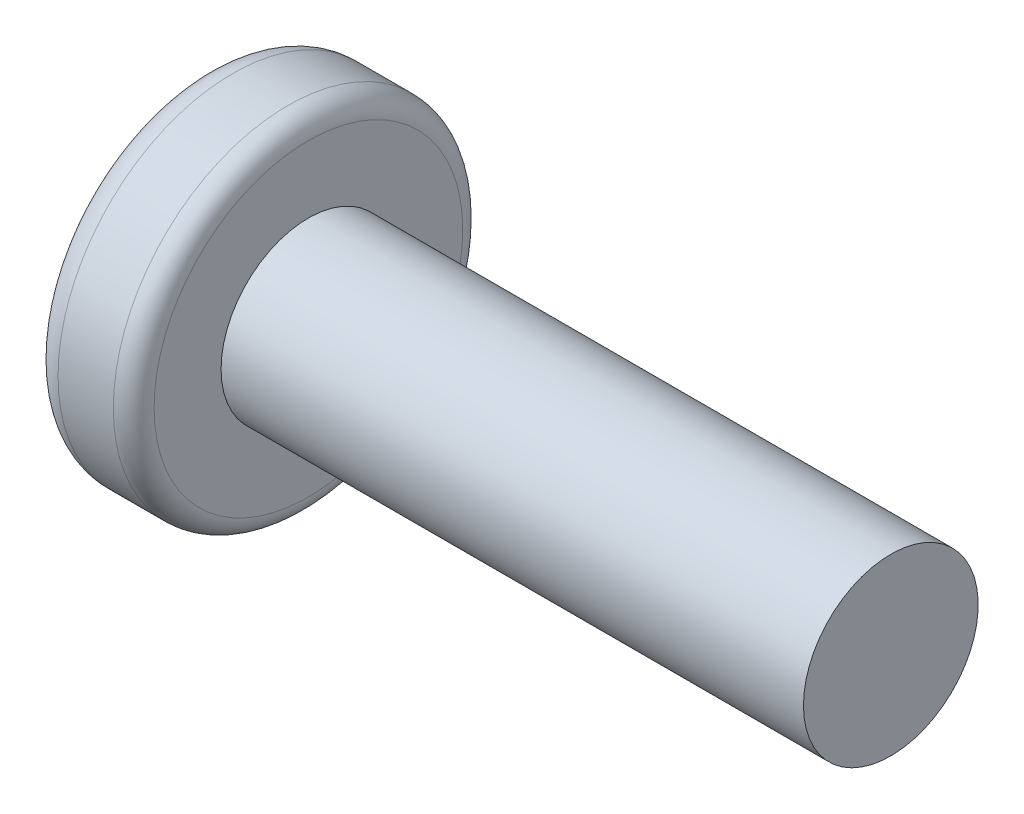
ISO-10303-21;
HEADER;
FILE_DESCRIPTION(('STEP AP214'),'2;1');
FILE_NAME('part.step','',(''),(''),'','','');
FILE_SCHEMA(('AUTOMOTIVE_DESIGN { 1 0 10303 214 1 1 1 1 }'));
ENDSEC;
DATA;
#1=APPLICATION_CONTEXT('core data for automotive mechanical design processes');
#2=APPLICATION_PROTOCOL_DEFINITION('international standard','automotive_design',2000,#1);
#3=PRODUCT_CONTEXT('',#1,'mechanical');
#4=PRODUCT('Part','Part','',(#3));
#5=PRODUCT_RELATED_PRODUCT_CATEGORY('part','',(#4));
#6=PRODUCT_DEFINITION_FORMATION('','',#4);
#7=PRODUCT_DEFINITION_CONTEXT('part definition',#1,'design');
#8=PRODUCT_DEFINITION('design','',#6,#7);
#9=PRODUCT_DEFINITION_SHAPE('','',#8);
#10=(LENGTH_UNIT() NAMED_UNIT(*) SI_UNIT(.MILLI.,.METRE.));
#11=(NAMED_UNIT(*) PLANE_ANGLE_UNIT() SI_UNIT($,.RADIAN.));
#12=(NAMED_UNIT(*) SI_UNIT($,.STERADIAN.) SOLID_ANGLE_UNIT());
#13=UNCERTAINTY_MEASURE_WITH_UNIT(LENGTH_MEASURE(1.E-05),#10,'distance_accuracy_value','');
#14=(GEOMETRIC_REPRESENTATION_CONTEXT(3) GLOBAL_UNCERTAINTY_ASSIGNED_CONTEXT((#13)) GLOBAL_UNIT_ASSIGNED_CONTEXT((#10,
#11,#12)) REPRESENTATION_CONTEXT('',''));
#15=CARTESIAN_POINT('',(0.,0.,0.));
#16=DIRECTION('',(0.,0.,1.));
#17=DIRECTION('',(1.,0.,0.));
#18=AXIS2_PLACEMENT_3D('',#15,#16,#17);
#19=CARTESIAN_POINT('',(1.8,-0.652553136470314,0.37));
#20=DIRECTION('',(0.,0.,-1.));
#21=DIRECTION('',(0.,1.,0.));
#22=AXIS2_PLACEMENT_3D('',#19,#20,#21);
#23=PLANE('',#22);
#24=DIRECTION('',(0.,1.,0.));
#25=VECTOR('',#24,1.);
#26=CARTESIAN_POINT('',(1.8,-0.652553136470314,0.37));
#27=LINE('',#26,#25);
#28=CARTESIAN_POINT('',(1.80000000000136,-0.415013252797762,0.37));
#29=VERTEX_POINT('',#28);
#30=CARTESIAN_POINT('',(1.8,-0.652553136470314,0.37));
#31=VERTEX_POINT('',#30);
#32=EDGE_CURVE('E155',#29,#31,#27,.F.);
#33=ORIENTED_EDGE('',*,*,#32,.T.);
#34=DIRECTION('',(0.89493436774996,0.446197800778958,0.));
#35=VECTOR('',#34,1.);
#36=CARTESIAN_POINT('',(0.,-1.55,0.37));
#37=LINE('',#36,#35);
#38=CARTESIAN_POINT('',(0.190827025346033,-1.45485715812583,0.370000000000001));
#39=VERTEX_POINT('',#38);
#40=EDGE_CURVE('E159',#31,#39,#37,.F.);
#41=ORIENTED_EDGE('',*,*,#40,.T.);
#42=CARTESIAN_POINT('',(0.190827025346032,-1.45485715812583,0.370000000000002));
#43=CARTESIAN_POINT('',(0.154367302900051,-1.30921009338373,0.370000000000002));
#44=CARTESIAN_POINT('',(0.12344880942392,-1.1626100074816,0.370000000000001));
#45=CARTESIAN_POINT('',(0.0726942804113583,-0.867503793357298,0.369999999999998));
#46=CARTESIAN_POINT('',(0.052858244874928,-0.718997665135119,0.369999999999996));
#47=CARTESIAN_POINT('',(0.0385634383083481,-0.569538515752914,0.369999999999994));
#48=B_SPLINE_CURVE_WITH_KNOTS('',3,(#42,#43,#44,#45,#46,#47),.UNSPECIFIED.,.F.,.F.,(4,2,4),(0.,
0.449475078094551,0.898950156189102),.UNSPECIFIED.);
#49=CARTESIAN_POINT('',(0.038563438301731,-0.569538515752785,0.369999999999999));
#50=VERTEX_POINT('',#49);
#51=EDGE_CURVE('E143',#39,#50,#48,.T.);
#52=ORIENTED_EDGE('',*,*,#51,.T.);
#53=CARTESIAN_POINT('',(0.0385634383038601,-0.569538515751931,0.37));
#54=CARTESIAN_POINT('',(0.249459860542259,-0.551934923003464,0.37));
#55=CARTESIAN_POINT('',(0.460339859439293,-0.534123508070556,0.37));
#56=CARTESIAN_POINT('',(0.882041379360187,-0.497847880570011,0.37));
#57=CARTESIAN_POINT('',(1.09286290096693,-0.479383674763409,0.37));
#58=CARTESIAN_POINT('',(1.38638432292663,-0.45305167766455,0.37));
#59=CARTESIAN_POINT('',(1.46911795021578,-0.445560447387079,0.37));
#60=CARTESIAN_POINT('',(1.63457063757802,-0.430415263407796,0.37));
#61=CARTESIAN_POINT('',(1.71728969759097,-0.422761309049558,0.37));
#62=CARTESIAN_POINT('',(1.80000000000095,-0.415013252799572,0.37));
#63=B_SPLINE_CURVE_WITH_KNOTS('',3,(#53,#54,#55,#56,#57,#58,#59,#60,#61,#62),.UNSPECIFIED.,.F.,
.F.,(4,2,2,2,4),(0.,0.634890893100427,1.2697752124818,1.51899132187324,1.76820843679097),.UNSPECIFIED.);
#64=EDGE_CURVE('E162',#50,#29,#63,.T.);
#65=ORIENTED_EDGE('',*,*,#64,.T.);
#66=EDGE_LOOP('',(#33,#41,#52,#65));
#67=FACE_BOUND('',#66,.T.);
#68=ADVANCED_FACE('F16',(#67),#23,.T.);
#69=CARTESIAN_POINT('',(0.,-1.55,-0.37));
#70=DIRECTION('',(0.446197800778958,-0.89493436774996,0.));
#71=DIRECTION('',(0.89493436774996,0.446197800778958,0.));
#72=AXIS2_PLACEMENT_3D('',#69,#70,#71);
#73=PLANE('',#72);
#74=DIRECTION('',(0.,0.,1.));
#75=VECTOR('',#74,1.);
#76=CARTESIAN_POINT('',(1.8,-0.652553136470314,-0.37));
#77=LINE('',#76,#75);
#78=CARTESIAN_POINT('',(1.8,-0.652553136470314,-0.37));
#79=VERTEX_POINT('',#78);
#80=EDGE_CURVE('E163',#79,#31,#77,.T.);
#81=ORIENTED_EDGE('',*,*,#80,.F.);
#82=DIRECTION('',(0.89493436774996,0.446197800778958,0.));
#83=VECTOR('',#82,1.);
#84=CARTESIAN_POINT('',(0.190827025346033,-1.45485715812583,-0.37));
#85=LINE('',#84,#83);
#86=CARTESIAN_POINT('',(0.190827025346033,-1.45485715812583,-0.37));
#87=VERTEX_POINT('',#86);
#88=EDGE_CURVE('E387',#87,#79,#85,.T.);
#89=ORIENTED_EDGE('',*,*,#88,.F.);
#90=CARTESIAN_POINT('',(0.180362378138894,-1.46007463857805,0.));
#91=CARTESIAN_POINT('',(0.180362378138894,-1.46007463857805,-0.185184771545176));
#92=CARTESIAN_POINT('',(0.190827025346033,-1.45485715812583,-0.37));
#93=B_SPLINE_CURVE_WITH_KNOTS('',2,(#90,#91,#92),.UNSPECIFIED.,.F.,.F.,(3,3),(0.,1.),.UNSPECIFIED.);
#94=CARTESIAN_POINT('',(0.180362378138895,-1.46007463857805,0.));
#95=VERTEX_POINT('',#94);
#96=EDGE_CURVE('E167',#95,#87,#93,.T.);
#97=ORIENTED_EDGE('',*,*,#96,.F.);
#98=CARTESIAN_POINT('',(0.190827025346033,-1.45485715812583,0.37));
#99=CARTESIAN_POINT('',(0.180362378138894,-1.46007463857805,0.185184771545178));
#100=CARTESIAN_POINT('',(0.180362378138894,-1.46007463857805,0.));
#101=B_SPLINE_CURVE_WITH_KNOTS('',2,(#98,#99,#100),.UNSPECIFIED.,.F.,.F.,(3,3),(0.,1.),.UNSPECIFIED.);
#102=EDGE_CURVE('E148',#39,#95,#101,.T.);
#103=ORIENTED_EDGE('',*,*,#102,.F.);
#104=ORIENTED_EDGE('',*,*,#40,.F.);
#105=EDGE_LOOP('',(#81,#89,#97,#103,#104));
#106=FACE_BOUND('',#105,.T.);
#107=ADVANCED_FACE('F165',(#106),#73,.F.);
#108=CARTESIAN_POINT('',(0.0385634382951139,0.,0.));
#109=DIRECTION('',(-1.,0.,0.));
#110=DIRECTION('',(0.,0.,1.));
#111=AXIS2_PLACEMENT_3D('',#108,#109,#110);
#112=CONICAL_SURFACE('',#111,0.679171643199084,0.0698131700791993);
#113=CARTESIAN_POINT('',(1.80000000000041,-0.370000000000004,0.415013252799509));
#114=CARTESIAN_POINT('',(1.62750312328878,-0.370000000000004,0.431158408094592));
#115=CARTESIAN_POINT('',(1.4549709538658,-0.370000000000004,0.446919627327146));
#116=CARTESIAN_POINT('',(1.10985337183026,-0.370000000000004,0.477835185334835));
#117=CARTESIAN_POINT('',(0.937267959598439,-0.370000000000004,0.492989528352763));
#118=CARTESIAN_POINT('',(0.643663887499248,-0.370000000000004,0.518388345690766));
#119=CARTESIAN_POINT('',(0.522654970223464,-0.370000000000004,0.528746146338188));
#120=CARTESIAN_POINT('',(0.280620669817226,-0.370000000000004,0.549274675541428));
#121=CARTESIAN_POINT('',(0.159595286609809,-0.370000000000004,0.559445403190324));
#122=CARTESIAN_POINT('',(0.0385634383060557,-0.370000000000004,0.56953851575178));
#123=B_SPLINE_CURVE_WITH_KNOTS('',3,(#113,#114,#115,#116,#117,#118,#119,#120,#121,#122),
.UNSPECIFIED.,.F.,.F.,(4,2,2,2,4),(0.,0.519751057577864,1.03949848083731,1.4038525661412,
1.76820841735493),.UNSPECIFIED.);
#124=CARTESIAN_POINT('',(1.80000000000136,-0.370000000000004,0.415013252797758));
#125=VERTEX_POINT('',#124);
#126=CARTESIAN_POINT('',(0.0385634383017358,-0.370000000000004,0.569538515718253));
#127=VERTEX_POINT('',#126);
#128=EDGE_CURVE('E195',#125,#127,#123,.T.);
#129=ORIENTED_EDGE('',*,*,#128,.F.);
#130=CARTESIAN_POINT('',(1.80000000000291,0.,0.));
#131=DIRECTION('',(-1.,0.,0.));
#132=DIRECTION('',(0.,0.,1.));
#133=AXIS2_PLACEMENT_3D('',#130,#131,#132);
#134=CIRCLE('',#133,0.555999999996004);
#135=EDGE_CURVE('E173',#29,#125,#134,.T.);
#136=ORIENTED_EDGE('',*,*,#135,.F.);
#137=ORIENTED_EDGE('',*,*,#64,.F.);
#138=CARTESIAN_POINT('',(0.0385634382951139,0.,0.));
#139=DIRECTION('',(-1.,0.,0.));
#140=DIRECTION('',(0.,0.,1.));
#141=AXIS2_PLACEMENT_3D('',#138,#139,#140);
#142=CIRCLE('',#141,0.679171643199084);
#143=EDGE_CURVE('E151',#127,#50,#142,.F.);
#144=ORIENTED_EDGE('',*,*,#143,.F.);
#145=EDGE_LOOP('',(#129,#136,#137,#144));
#146=FACE_BOUND('',#145,.T.);
#147=ADVANCED_FACE('F184',(#146),#112,.F.);
#148=CARTESIAN_POINT('',(1.8,0.652553136470314,-0.37));
#149=DIRECTION('',(0.,0.,1.));
#150=DIRECTION('',(1.,0.,0.));
#151=AXIS2_PLACEMENT_3D('',#148,#149,#150);
#152=PLANE('',#151);
#153=CARTESIAN_POINT('',(0.0385634383083481,-0.56953851575291,-0.370000000000001));
#154=CARTESIAN_POINT('',(0.0528582448749278,-0.718997665135116,-0.370000000000002));
#155=CARTESIAN_POINT('',(0.0726942804113581,-0.867503793357296,-0.370000000000001));
#156=CARTESIAN_POINT('',(0.12344880942392,-1.16261000748161,-0.369999999999999));
#157=CARTESIAN_POINT('',(0.154367302900051,-1.30921009338373,-0.369999999999997));
#158=CARTESIAN_POINT('',(0.190827025346034,-1.45485715812584,-0.369999999999994));
#159=B_SPLINE_CURVE_WITH_KNOTS('',3,(#153,#154,#155,#156,#157,#158),.UNSPECIFIED.,.F.,.F.,(4,2,
4),(0.,0.449475078094555,0.89895015618911),.UNSPECIFIED.);
#160=CARTESIAN_POINT('',(0.0385634383061041,-0.569538515752421,-0.370000000000001));
#161=VERTEX_POINT('',#160);
#162=EDGE_CURVE('E392',#161,#87,#159,.T.);
#163=ORIENTED_EDGE('',*,*,#162,.T.);
#164=ORIENTED_EDGE('',*,*,#88,.T.);
#165=DIRECTION('',(0.,1.,0.));
#166=VECTOR('',#165,1.);
#167=CARTESIAN_POINT('',(1.8,0.652553136470314,-0.37));
#168=LINE('',#167,#166);
#169=CARTESIAN_POINT('',(1.80000000000136,-0.415013252797762,-0.37));
#170=VERTEX_POINT('',#169);
#171=EDGE_CURVE('E395',#79,#170,#168,.T.);
#172=ORIENTED_EDGE('',*,*,#171,.T.);
#173=CARTESIAN_POINT('',(1.80000000000094,-0.415013252799463,-0.37));
#174=CARTESIAN_POINT('',(1.62750312328932,-0.431158408094546,-0.37));
#175=CARTESIAN_POINT('',(1.45497095386635,-0.446919627327099,-0.37));
#176=CARTESIAN_POINT('',(1.10985337183084,-0.477835185334787,-0.37));
#177=CARTESIAN_POINT('',(0.937267959599024,-0.492989528352715,-0.37));
#178=CARTESIAN_POINT('',(0.64366388749938,-0.518388345690758,-0.37));
#179=CARTESIAN_POINT('',(0.522654970223131,-0.52874614633822,-0.37));
#180=CARTESIAN_POINT('',(0.280620669815963,-0.549274675541538,-0.37));
#181=CARTESIAN_POINT('',(0.159595286608081,-0.559445403190472,-0.37));
#182=CARTESIAN_POINT('',(0.0385634383038632,-0.569538515751965,-0.37));
#183=B_SPLINE_CURVE_WITH_KNOTS('',3,(#173,#174,#175,#176,#177,#178,#179,#180,#181,#182),
.UNSPECIFIED.,.F.,.F.,(4,2,2,2,4),(0.,0.51975105757783,1.03949848083724,1.40385256614253,
1.76820841735766),.UNSPECIFIED.);
#184=EDGE_CURVE('E474',#170,#161,#183,.T.);
#185=ORIENTED_EDGE('',*,*,#184,.T.);
#186=EDGE_LOOP('',(#163,#164,#172,#185));
#187=FACE_BOUND('',#186,.T.);
#188=ADVANCED_FACE('F189',(#187),#152,.T.);
#189=CARTESIAN_POINT('',(1.8,-0.37,-0.652553136470316));
#190=DIRECTION('',(0.,1.,0.));
#191=DIRECTION('',(0.,0.,1.));
#192=AXIS2_PLACEMENT_3D('',#189,#190,#191);
#193=PLANE('',#192);
#194=CARTESIAN_POINT('',(6.,-0.370000000000004,0.));
#195=DIRECTION('',(0.,1.,0.));
#196=DIRECTION('',(0.,0.,1.));
#197=AXIS2_PLACEMENT_3D('',#194,#195,#196);
#198=CIRCLE('',#197,5.98858080015624);
#199=CARTESIAN_POINT('',(0.190827025346033,-0.370000000000005,1.45485715812583));
#200=VERTEX_POINT('',#199);
#201=EDGE_CURVE('E411',#127,#200,#198,.T.);
#202=ORIENTED_EDGE('',*,*,#201,.T.);
#203=DIRECTION('',(0.89493436774996,0.,-0.446197800778958));
#204=VECTOR('',#203,1.);
#205=CARTESIAN_POINT('',(1.8,-0.370000000000005,0.652553136470313));
#206=LINE('',#205,#204);
#207=CARTESIAN_POINT('',(1.8,-0.370000000000005,0.652553136470313));
#208=VERTEX_POINT('',#207);
#209=EDGE_CURVE('E369',#200,#208,#206,.T.);
#210=ORIENTED_EDGE('',*,*,#209,.T.);
#211=DIRECTION('',(0.,0.,1.));
#212=VECTOR('',#211,1.);
#213=CARTESIAN_POINT('',(1.8,-0.37,-0.652553136470316));
#214=LINE('',#213,#212);
#215=EDGE_CURVE('E384',#208,#125,#214,.F.);
#216=ORIENTED_EDGE('',*,*,#215,.T.);
#217=ORIENTED_EDGE('',*,*,#128,.T.);
#218=EDGE_LOOP('',(#202,#210,#216,#217));
#219=FACE_BOUND('',#218,.T.);
#220=ADVANCED_FACE('F412',(#219),#193,.T.);
#221=CARTESIAN_POINT('',(0.0385634382951139,0.,0.));
#222=DIRECTION('',(-1.,0.,0.));
#223=DIRECTION('',(0.,0.,1.));
#224=AXIS2_PLACEMENT_3D('',#221,#222,#223);
#225=CONICAL_SURFACE('',#224,0.679171643199084,0.0698131700791993);
#226=CARTESIAN_POINT('',(0.0385634383060528,-0.37,-0.569538515751748));
#227=CARTESIAN_POINT('',(0.249459860544404,-0.37,-0.551934923003283));
#228=CARTESIAN_POINT('',(0.46033985944139,-0.37,-0.534123508070378));
#229=CARTESIAN_POINT('',(0.882041379362188,-0.37,-0.497847880569836));
#230=CARTESIAN_POINT('',(1.09286290096888,-0.370000000000001,-0.479383674763236));
#231=CARTESIAN_POINT('',(1.38638432292813,-0.370000000000001,-0.453051677664414));
#232=CARTESIAN_POINT('',(1.46911795021688,-0.370000000000001,-0.445560447386978));
#233=CARTESIAN_POINT('',(1.6345706375783,-0.370000000000001,-0.430415263407769));
#234=CARTESIAN_POINT('',(1.71728969759085,-0.370000000000001,-0.422761309049568));
#235=CARTESIAN_POINT('',(1.80000000000042,-0.370000000000001,-0.415013252799621));
#236=B_SPLINE_CURVE_WITH_KNOTS('',3,(#226,#227,#228,#229,#230,#231,#232,#233,#234,#235),
.UNSPECIFIED.,.F.,.F.,(4,2,2,2,4),(0.,0.634890893100284,1.26977521248151,1.51899132187174,
1.76820843678824),.UNSPECIFIED.);
#237=CARTESIAN_POINT('',(0.0385634382951139,-0.369999999999999,-0.569538515718087));
#238=VERTEX_POINT('',#237);
#239=CARTESIAN_POINT('',(1.80000000000136,-0.370000000000001,-0.415013252797761));
#240=VERTEX_POINT('',#239);
#241=EDGE_CURVE('E366',#238,#240,#236,.T.);
#242=ORIENTED_EDGE('',*,*,#241,.F.);
#243=CARTESIAN_POINT('',(0.0385634382951139,0.,0.));
#244=DIRECTION('',(-1.,0.,0.));
#245=DIRECTION('',(0.,0.,1.));
#246=AXIS2_PLACEMENT_3D('',#243,#244,#245);
#247=CIRCLE('',#246,0.679171643199084);
#248=EDGE_CURVE('E383',#161,#238,#247,.F.);
#249=ORIENTED_EDGE('',*,*,#248,.F.);
#250=ORIENTED_EDGE('',*,*,#184,.F.);
#251=CARTESIAN_POINT('',(1.80000000000291,0.,0.));
#252=DIRECTION('',(-1.,0.,0.));
#253=DIRECTION('',(0.,0.,1.));
#254=AXIS2_PLACEMENT_3D('',#251,#252,#253);
#255=CIRCLE('',#254,0.555999999996004);
#256=EDGE_CURVE('E380',#240,#170,#255,.T.);
#257=ORIENTED_EDGE('',*,*,#256,.F.);
#258=EDGE_LOOP('',(#242,#249,#250,#257));
#259=FACE_BOUND('',#258,.T.);
#260=ADVANCED_FACE('F482',(#259),#225,.F.);
#261=CARTESIAN_POINT('',(1.8,-0.37,0.652553136470313));
#262=DIRECTION('',(0.446197800778958,0.,0.89493436774996));
#263=DIRECTION('',(0.89493436774996,0.,-0.446197800778958));
#264=AXIS2_PLACEMENT_3D('',#261,#262,#263);
#265=PLANE('',#264);
#266=DIRECTION('',(0.,1.,0.));
#267=VECTOR('',#266,1.);
#268=CARTESIAN_POINT('',(1.8,-0.37,0.652553136470313));
#269=LINE('',#268,#267);
#270=CARTESIAN_POINT('',(1.8,0.37,0.652553136470315));
#271=VERTEX_POINT('',#270);
#272=EDGE_CURVE('E372',#208,#271,#269,.T.);
#273=ORIENTED_EDGE('',*,*,#272,.F.);
#274=ORIENTED_EDGE('',*,*,#209,.F.);
#275=CARTESIAN_POINT('',(0.190827025346032,0.369999999999997,1.45485715812583));
#276=CARTESIAN_POINT('',(0.183850593874607,0.246666666666663,1.45833547842731));
#277=CARTESIAN_POINT('',(0.180362378138894,0.123333333333329,1.46007463857805));
#278=CARTESIAN_POINT('',(0.180362378138894,-0.123333333333338,1.46007463857805));
#279=CARTESIAN_POINT('',(0.183850593874607,-0.246666666666672,1.45833547842731));
#280=CARTESIAN_POINT('',(0.190827025346031,-0.370000000000006,1.45485715812583));
#281=B_SPLINE_CURVE_WITH_KNOTS('',3,(#275,#276,#277,#278,#279,#280),.UNSPECIFIED.,.F.,.F.,(4,2,
4),(0.,0.370184725432371,0.740369450864742),.UNSPECIFIED.);
#282=CARTESIAN_POINT('',(0.190827025346032,0.369999999999992,1.45485715812584));
#283=VERTEX_POINT('',#282);
#284=EDGE_CURVE('E373',#283,#200,#281,.T.);
#285=ORIENTED_EDGE('',*,*,#284,.F.);
#286=DIRECTION('',(-0.894934367749961,0.,0.446197800778958));
#287=VECTOR('',#286,1.);
#288=CARTESIAN_POINT('',(1.8,0.37,0.652553136470316));
#289=LINE('',#288,#287);
#290=EDGE_CURVE('E358',#271,#283,#289,.T.);
#291=ORIENTED_EDGE('',*,*,#290,.F.);
#292=EDGE_LOOP('',(#273,#274,#285,#291));
#293=FACE_BOUND('',#292,.T.);
#294=ADVANCED_FACE('F502',(#293),#265,.F.);
#295=CARTESIAN_POINT('',(1.8,-0.37,-0.652553136470316));
#296=DIRECTION('',(0.,1.,0.));
#297=DIRECTION('',(0.,0.,1.));
#298=AXIS2_PLACEMENT_3D('',#295,#296,#297);
#299=PLANE('',#298);
#300=DIRECTION('',(0.,0.,1.));
#301=VECTOR('',#300,1.);
#302=CARTESIAN_POINT('',(1.8,-0.37,-0.652553136470316));
#303=LINE('',#302,#301);
#304=CARTESIAN_POINT('',(1.8,-0.37,-0.652553136470315));
#305=VERTEX_POINT('',#304);
#306=EDGE_CURVE('E364',#240,#305,#303,.F.);
#307=ORIENTED_EDGE('',*,*,#306,.T.);
#308=DIRECTION('',(-0.89493436774996,0.,-0.446197800778958));
#309=VECTOR('',#308,1.);
#310=CARTESIAN_POINT('',(0.,-0.37,-1.55));
#311=LINE('',#310,#309);
#312=CARTESIAN_POINT('',(0.190827025346034,-0.369999999999996,-1.45485715812584));
#313=VERTEX_POINT('',#312);
#314=EDGE_CURVE('E348',#305,#313,#311,.T.);
#315=ORIENTED_EDGE('',*,*,#314,.T.);
#316=CARTESIAN_POINT('',(6.,-0.369999999999998,0.));
#317=DIRECTION('',(0.,1.,0.));
#318=DIRECTION('',(0.,0.,1.));
#319=AXIS2_PLACEMENT_3D('',#316,#317,#318);
#320=CIRCLE('',#319,5.98858080015624);
#321=EDGE_CURVE('E377',#313,#238,#320,.T.);
#322=ORIENTED_EDGE('',*,*,#321,.T.);
#323=ORIENTED_EDGE('',*,*,#241,.T.);
#324=EDGE_LOOP('',(#307,#315,#322,#323));
#325=FACE_BOUND('',#324,.T.);
#326=ADVANCED_FACE('F486',(#325),#299,.T.);
#327=CARTESIAN_POINT('',(1.8,0.652553136470314,-0.37));
#328=DIRECTION('',(-1.,0.,0.));
#329=DIRECTION('',(0.,0.,1.));
#330=AXIS2_PLACEMENT_3D('',#327,#328,#329);
#331=PLANE('',#330);
#332=ORIENTED_EDGE('',*,*,#171,.F.);
#333=ORIENTED_EDGE('',*,*,#80,.T.);
#334=ORIENTED_EDGE('',*,*,#32,.F.);
#335=CARTESIAN_POINT('',(1.79999999999981,0.,0.));
#336=DIRECTION('',(-1.,0.,0.));
#337=DIRECTION('',(0.,0.,1.));
#338=AXIS2_PLACEMENT_3D('',#335,#336,#337);
#339=CIRCLE('',#338,0.556000000000001);
#340=EDGE_CURVE('E344',#29,#170,#339,.F.);
#341=ORIENTED_EDGE('',*,*,#340,.T.);
#342=EDGE_LOOP('',(#332,#333,#334,#341));
#343=FACE_BOUND('',#342,.T.);
#344=ADVANCED_FACE('F472',(#343),#331,.T.);
#345=CARTESIAN_POINT('',(1.8,0.37,0.652553136470316));
#346=DIRECTION('',(0.,-1.,0.));
#347=DIRECTION('',(0.,0.,-1.));
#348=AXIS2_PLACEMENT_3D('',#345,#346,#347);
#349=PLANE('',#348);
#350=DIRECTION('',(0.,0.,1.));
#351=VECTOR('',#350,1.);
#352=CARTESIAN_POINT('',(1.8,0.37,-0.37));
#353=LINE('',#352,#351);
#354=CARTESIAN_POINT('',(1.80000000000011,0.37,0.415013252799976));
#355=VERTEX_POINT('',#354);
#356=EDGE_CURVE('E341',#271,#355,#353,.F.);
#357=ORIENTED_EDGE('',*,*,#356,.F.);
#358=ORIENTED_EDGE('',*,*,#290,.T.);
#359=CARTESIAN_POINT('',(6.,0.369999999999996,0.));
#360=DIRECTION('',(0.,1.,0.));
#361=DIRECTION('',(0.,0.,1.));
#362=AXIS2_PLACEMENT_3D('',#359,#360,#361);
#363=CIRCLE('',#362,5.98858080015625);
#364=CARTESIAN_POINT('',(0.038563438301731,0.369999999999996,0.56953851571822));
#365=VERTEX_POINT('',#364);
#366=EDGE_CURVE('E361',#283,#365,#363,.F.);
#367=ORIENTED_EDGE('',*,*,#366,.T.);
#368=CARTESIAN_POINT('',(0.0385634383038612,0.37,0.56953851575193));
#369=CARTESIAN_POINT('',(0.24945986054226,0.37,0.551934923003463));
#370=CARTESIAN_POINT('',(0.460339859439294,0.37,0.534123508070556));
#371=CARTESIAN_POINT('',(0.882041379360188,0.370000000000001,0.49784788057001));
#372=CARTESIAN_POINT('',(1.09286290096693,0.370000000000001,0.479383674763409));
#373=CARTESIAN_POINT('',(1.38638432292654,0.370000000000001,0.453051677664558));
#374=CARTESIAN_POINT('',(1.4691179502156,0.370000000000001,0.445560447387094));
#375=CARTESIAN_POINT('',(1.63457063757765,0.370000000000001,0.430415263407829));
#376=CARTESIAN_POINT('',(1.71728969759052,0.370000000000001,0.422761309049599));
#377=CARTESIAN_POINT('',(1.80000000000041,0.370000000000001,0.415013252799622));
#378=B_SPLINE_CURVE_WITH_KNOTS('',3,(#368,#369,#370,#371,#372,#373,#374,#375,#376,#377),
.UNSPECIFIED.,.F.,.F.,(4,2,2,2,4),(0.,0.634890893100427,1.2697752124818,1.51899132187297,
1.76820843679043),.UNSPECIFIED.);
#379=EDGE_CURVE('E308',#365,#355,#378,.T.);
#380=ORIENTED_EDGE('',*,*,#379,.T.);
#381=EDGE_LOOP('',(#357,#358,#367,#380));
#382=FACE_BOUND('',#381,.T.);
#383=ADVANCED_FACE('F419',(#382),#349,.T.);
#384=CARTESIAN_POINT('',(0.,0.370000000000006,-1.55));
#385=DIRECTION('',(0.446197800778958,0.,-0.89493436774996));
#386=DIRECTION('',(-0.89493436774996,0.,-0.446197800778958));
#387=AXIS2_PLACEMENT_3D('',#384,#385,#386);
#388=PLANE('',#387);
#389=DIRECTION('',(0.,1.,0.));
#390=VECTOR('',#389,1.);
#391=CARTESIAN_POINT('',(1.8,0.652553136470314,-0.652553136470313));
#392=LINE('',#391,#390);
#393=CARTESIAN_POINT('',(1.8,0.370000000000003,-0.652553136470313));
#394=VERTEX_POINT('',#393);
#395=EDGE_CURVE('E345',#394,#305,#392,.F.);
#396=ORIENTED_EDGE('',*,*,#395,.F.);
#397=DIRECTION('',(0.89493436774996,0.,0.446197800778958));
#398=VECTOR('',#397,1.);
#399=CARTESIAN_POINT('',(0.190827025346033,0.370000000000008,-1.45485715812583));
#400=LINE('',#399,#398);
#401=CARTESIAN_POINT('',(0.190827025346034,0.37000000000001,-1.45485715812583));
#402=VERTEX_POINT('',#401);
#403=EDGE_CURVE('E325',#402,#394,#400,.T.);
#404=ORIENTED_EDGE('',*,*,#403,.F.);
#405=CARTESIAN_POINT('',(0.190827025346034,-0.369999999999996,-1.45485715812584));
#406=CARTESIAN_POINT('',(0.183850593874607,-0.246666666666663,-1.45833547842732));
#407=CARTESIAN_POINT('',(0.180362378138894,-0.123333333333329,-1.46007463857805));
#408=CARTESIAN_POINT('',(0.180362378138894,0.123333333333339,-1.46007463857805));
#409=CARTESIAN_POINT('',(0.183850593874607,0.246666666666672,-1.45833547842731));
#410=CARTESIAN_POINT('',(0.190827025346033,0.370000000000006,-1.45485715812583));
#411=B_SPLINE_CURVE_WITH_KNOTS('',3,(#405,#406,#407,#408,#409,#410),.UNSPECIFIED.,.F.,.F.,(4,2,
4),(0.,0.370184725432371,0.740369450864742),.UNSPECIFIED.);
#412=EDGE_CURVE('E351',#313,#402,#411,.T.);
#413=ORIENTED_EDGE('',*,*,#412,.F.);
#414=ORIENTED_EDGE('',*,*,#314,.F.);
#415=EDGE_LOOP('',(#396,#404,#413,#414));
#416=FACE_BOUND('',#415,.T.);
#417=ADVANCED_FACE('F521',(#416),#388,.F.);
#418=CARTESIAN_POINT('',(1.8,0.652553136470314,-0.37));
#419=DIRECTION('',(-1.,0.,0.));
#420=DIRECTION('',(0.,0.,1.));
#421=AXIS2_PLACEMENT_3D('',#418,#419,#420);
#422=PLANE('',#421);
#423=DIRECTION('',(0.,0.,-1.));
#424=VECTOR('',#423,1.);
#425=CARTESIAN_POINT('',(1.8,0.37,0.652553136470316));
#426=LINE('',#425,#424);
#427=CARTESIAN_POINT('',(1.80000000000136,0.370000000000003,-0.415013252797759));
#428=VERTEX_POINT('',#427);
#429=EDGE_CURVE('E328',#394,#428,#426,.F.);
#430=ORIENTED_EDGE('',*,*,#429,.F.);
#431=ORIENTED_EDGE('',*,*,#395,.T.);
#432=ORIENTED_EDGE('',*,*,#306,.F.);
#433=CARTESIAN_POINT('',(1.79999999999981,0.,0.));
#434=DIRECTION('',(-1.,0.,0.));
#435=DIRECTION('',(0.,0.,1.));
#436=AXIS2_PLACEMENT_3D('',#433,#434,#435);
#437=CIRCLE('',#436,0.556000000000001);
#438=EDGE_CURVE('E324',#240,#428,#437,.F.);
#439=ORIENTED_EDGE('',*,*,#438,.T.);
#440=EDGE_LOOP('',(#430,#431,#432,#439));
#441=FACE_BOUND('',#440,.T.);
#442=ADVANCED_FACE('F524',(#441),#422,.T.);
#443=CARTESIAN_POINT('',(1.8,0.652553136470314,-0.37));
#444=DIRECTION('',(-1.,0.,0.));
#445=DIRECTION('',(0.,0.,1.));
#446=AXIS2_PLACEMENT_3D('',#443,#444,#445);
#447=PLANE('',#446);
#448=ORIENTED_EDGE('',*,*,#215,.F.);
#449=ORIENTED_EDGE('',*,*,#272,.T.);
#450=ORIENTED_EDGE('',*,*,#356,.T.);
#451=CARTESIAN_POINT('',(1.79999999999981,0.,0.));
#452=DIRECTION('',(-1.,0.,0.));
#453=DIRECTION('',(0.,0.,1.));
#454=AXIS2_PLACEMENT_3D('',#451,#452,#453);
#455=CIRCLE('',#454,0.556000000000001);
#456=EDGE_CURVE('E321',#355,#125,#455,.F.);
#457=ORIENTED_EDGE('',*,*,#456,.T.);
#458=EDGE_LOOP('',(#448,#449,#450,#457));
#459=FACE_BOUND('',#458,.T.);
#460=ADVANCED_FACE('F303',(#459),#447,.T.);
#461=CARTESIAN_POINT('',(0.0385634382951139,0.,0.));
#462=DIRECTION('',(-1.,0.,0.));
#463=DIRECTION('',(0.,0.,1.));
#464=AXIS2_PLACEMENT_3D('',#461,#462,#463);
#465=CONICAL_SURFACE('',#464,0.679171643199084,0.0698131700791993);
#466=ORIENTED_EDGE('',*,*,#379,.F.);
#467=CARTESIAN_POINT('',(0.0385634382951139,0.,0.));
#468=DIRECTION('',(-1.,0.,0.));
#469=DIRECTION('',(0.,0.,1.));
#470=AXIS2_PLACEMENT_3D('',#467,#468,#469);
#471=CIRCLE('',#470,0.679171643199084);
#472=CARTESIAN_POINT('',(0.0385634383017353,0.569538515752825,0.369999999999999));
#473=VERTEX_POINT('',#472);
#474=EDGE_CURVE('E335',#473,#365,#471,.F.);
#475=ORIENTED_EDGE('',*,*,#474,.F.);
#476=CARTESIAN_POINT('',(1.79999999999987,0.415013252799563,0.37));
#477=CARTESIAN_POINT('',(1.62750312328823,0.431158408094646,0.37));
#478=CARTESIAN_POINT('',(1.45497095386524,0.4469196273272,0.37));
#479=CARTESIAN_POINT('',(1.10985337182967,0.47783518533489,0.37));
#480=CARTESIAN_POINT('',(0.937267959597838,0.492989528352819,0.37));
#481=CARTESIAN_POINT('',(0.643663887498738,0.518388345690813,0.37));
#482=CARTESIAN_POINT('',(0.522654970223056,0.528746146338226,0.37));
#483=CARTESIAN_POINT('',(0.280620669817021,0.549274675541448,0.37));
#484=CARTESIAN_POINT('',(0.159595286609706,0.559445403190336,0.37));
#485=CARTESIAN_POINT('',(0.0385634383060554,0.569538515751783,0.37));
#486=B_SPLINE_CURVE_WITH_KNOTS('',3,(#476,#477,#478,#479,#480,#481,#482,#483,#484,#485),
.UNSPECIFIED.,.F.,.F.,(4,2,2,2,4),(0.,0.5197510575779,1.03949848083738,1.40385256614097,
1.76820841735439),.UNSPECIFIED.);
#487=CARTESIAN_POINT('',(1.79999999999984,0.415013252800001,0.37));
#488=VERTEX_POINT('',#487);
#489=EDGE_CURVE('E315',#488,#473,#486,.T.);
#490=ORIENTED_EDGE('',*,*,#489,.F.);
#491=CARTESIAN_POINT('',(1.79999999999991,0.,0.));
#492=DIRECTION('',(-1.,0.,0.));
#493=DIRECTION('',(0.,0.,1.));
#494=AXIS2_PLACEMENT_3D('',#491,#492,#493);
#495=CIRCLE('',#494,0.556000000000001);
#496=EDGE_CURVE('E323',#488,#355,#495,.F.);
#497=ORIENTED_EDGE('',*,*,#496,.T.);
#498=EDGE_LOOP('',(#466,#475,#490,#497));
#499=FACE_BOUND('',#498,.T.);
#500=ADVANCED_FACE('F298',(#499),#465,.F.);
#501=CARTESIAN_POINT('',(1.8,0.37,0.652553136470316));
#502=DIRECTION('',(0.,-1.,0.));
#503=DIRECTION('',(0.,0.,-1.));
#504=AXIS2_PLACEMENT_3D('',#501,#502,#503);
#505=PLANE('',#504);
#506=CARTESIAN_POINT('',(6.,0.370000000000005,0.));
#507=DIRECTION('',(0.,1.,0.));
#508=DIRECTION('',(0.,0.,1.));
#509=AXIS2_PLACEMENT_3D('',#506,#507,#508);
#510=CIRCLE('',#509,5.98858080015624);
#511=CARTESIAN_POINT('',(0.0385634383017319,0.370000000000005,-0.569538515718213));
#512=VERTEX_POINT('',#511);
#513=EDGE_CURVE('E326',#512,#402,#510,.F.);
#514=ORIENTED_EDGE('',*,*,#513,.T.);
#515=ORIENTED_EDGE('',*,*,#403,.T.);
#516=ORIENTED_EDGE('',*,*,#429,.T.);
#517=CARTESIAN_POINT('',(1.80000000000094,0.370000000000004,-0.41501325279946));
#518=CARTESIAN_POINT('',(1.62750312328932,0.370000000000004,-0.431158408094543));
#519=CARTESIAN_POINT('',(1.45497095386635,0.370000000000004,-0.446919627327096));
#520=CARTESIAN_POINT('',(1.10985337183084,0.370000000000004,-0.477835185334784));
#521=CARTESIAN_POINT('',(0.937267959599023,0.370000000000004,-0.492989528352712));
#522=CARTESIAN_POINT('',(0.64366388749938,0.370000000000004,-0.518388345690755));
#523=CARTESIAN_POINT('',(0.522654970223131,0.370000000000004,-0.528746146338217));
#524=CARTESIAN_POINT('',(0.280620669815963,0.370000000000004,-0.549274675541535));
#525=CARTESIAN_POINT('',(0.159595286608082,0.370000000000004,-0.559445403190469));
#526=CARTESIAN_POINT('',(0.0385634383038641,0.370000000000004,-0.569538515751963));
#527=B_SPLINE_CURVE_WITH_KNOTS('',3,(#517,#518,#519,#520,#521,#522,#523,#524,#525,#526),
.UNSPECIFIED.,.F.,.F.,(4,2,2,2,4),(0.,0.51975105757783,1.03949848083724,1.40385256614253,
1.76820841735766),.UNSPECIFIED.);
#528=EDGE_CURVE('E278',#428,#512,#527,.T.);
#529=ORIENTED_EDGE('',*,*,#528,.T.);
#530=EDGE_LOOP('',(#514,#515,#516,#529));
#531=FACE_BOUND('',#530,.T.);
#532=ADVANCED_FACE('F293',(#531),#505,.T.);
#533=CARTESIAN_POINT('',(1.80000000000025,0.,0.));
#534=DIRECTION('',(-1.,0.,0.));
#535=DIRECTION('',(0.,0.,1.));
#536=AXIS2_PLACEMENT_3D('',#533,#534,#535);
#537=CONICAL_SURFACE('',#536,0.555999999998669,1.25663706143256);
#538=CARTESIAN_POINT('',(1.98065535110548,0.,0.));
#539=VERTEX_POINT('',#538);
#540=VERTEX_LOOP('',#539);
#541=FACE_BOUND('',#540,.T.);
#542=ORIENTED_EDGE('',*,*,#135,.T.);
#543=ORIENTED_EDGE('',*,*,#456,.F.);
#544=ORIENTED_EDGE('',*,*,#496,.F.);
#545=CARTESIAN_POINT('',(1.79999999999981,0.,0.));
#546=DIRECTION('',(-1.,0.,0.));
#547=DIRECTION('',(0.,0.,1.));
#548=AXIS2_PLACEMENT_3D('',#545,#546,#547);
#549=CIRCLE('',#548,0.556000000000001);
#550=CARTESIAN_POINT('',(1.80000000000136,0.415013252797762,-0.37));
#551=VERTEX_POINT('',#550);
#552=EDGE_CURVE('E432',#551,#488,#549,.F.);
#553=ORIENTED_EDGE('',*,*,#552,.F.);
#554=CARTESIAN_POINT('',(1.80000000000291,0.,0.));
#555=DIRECTION('',(-1.,0.,0.));
#556=DIRECTION('',(0.,0.,1.));
#557=AXIS2_PLACEMENT_3D('',#554,#555,#556);
#558=CIRCLE('',#557,0.555999999996004);
#559=EDGE_CURVE('E287',#551,#428,#558,.T.);
#560=ORIENTED_EDGE('',*,*,#559,.T.);
#561=ORIENTED_EDGE('',*,*,#438,.F.);
#562=ORIENTED_EDGE('',*,*,#256,.T.);
#563=ORIENTED_EDGE('',*,*,#340,.F.);
#564=EDGE_LOOP('',(#542,#543,#544,#553,#560,#561,#562,#563));
#565=FACE_BOUND('',#564,.T.);
#566=ADVANCED_FACE('F297',(#541,#565),#537,.F.);
#567=CARTESIAN_POINT('',(1.8,-0.652553136470314,0.37));
#568=DIRECTION('',(0.,0.,-1.));
#569=DIRECTION('',(0.,1.,0.));
#570=AXIS2_PLACEMENT_3D('',#567,#568,#569);
#571=PLANE('',#570);
#572=CARTESIAN_POINT('',(0.0385634383083568,0.569538515752989,0.369999999999998));
#573=CARTESIAN_POINT('',(0.0528582448749366,0.718997665135182,0.37));
#574=CARTESIAN_POINT('',(0.0726942804113664,0.867503793357349,0.37));
#575=CARTESIAN_POINT('',(0.123448809423926,1.16261000748163,0.37));
#576=CARTESIAN_POINT('',(0.154367302900056,1.30921009338375,0.369999999999998));
#577=CARTESIAN_POINT('',(0.190827025346035,1.45485715812584,0.369999999999996));
#578=B_SPLINE_CURVE_WITH_KNOTS('',3,(#572,#573,#574,#575,#576,#577),.UNSPECIFIED.,.F.,.F.,(4,2,
4),(0.,0.449475078094516,0.898950156189033),.UNSPECIFIED.);
#579=CARTESIAN_POINT('',(0.190827025346034,1.45485715812583,0.370000000000001));
#580=VERTEX_POINT('',#579);
#581=EDGE_CURVE('E288',#473,#580,#578,.T.);
#582=ORIENTED_EDGE('',*,*,#581,.T.);
#583=DIRECTION('',(-0.89493436774996,0.446197800778958,0.));
#584=VECTOR('',#583,1.);
#585=CARTESIAN_POINT('',(1.8,0.652553136470314,0.37));
#586=LINE('',#585,#584);
#587=CARTESIAN_POINT('',(1.8,0.652553136470314,0.37));
#588=VERTEX_POINT('',#587);
#589=EDGE_CURVE('E437',#580,#588,#586,.F.);
#590=ORIENTED_EDGE('',*,*,#589,.T.);
#591=DIRECTION('',(0.,1.,0.));
#592=VECTOR('',#591,1.);
#593=CARTESIAN_POINT('',(1.8,0.652553136470314,0.37));
#594=LINE('',#593,#592);
#595=EDGE_CURVE('E244',#488,#588,#594,.T.);
#596=ORIENTED_EDGE('',*,*,#595,.F.);
#597=ORIENTED_EDGE('',*,*,#489,.T.);
#598=EDGE_LOOP('',(#582,#590,#596,#597));
#599=FACE_BOUND('',#598,.T.);
#600=ADVANCED_FACE('F266',(#599),#571,.T.);
#601=CARTESIAN_POINT('',(0.0385634382951139,0.,0.));
#602=DIRECTION('',(-1.,0.,0.));
#603=DIRECTION('',(0.,0.,1.));
#604=AXIS2_PLACEMENT_3D('',#601,#602,#603);
#605=CONICAL_SURFACE('',#604,0.679171643199084,0.0698131700791993);
#606=ORIENTED_EDGE('',*,*,#528,.F.);
#607=ORIENTED_EDGE('',*,*,#559,.F.);
#608=CARTESIAN_POINT('',(0.0385634383060523,0.569538515751748,-0.37));
#609=CARTESIAN_POINT('',(0.249459860544403,0.551934923003283,-0.37));
#610=CARTESIAN_POINT('',(0.460339859441389,0.534123508070378,-0.37));
#611=CARTESIAN_POINT('',(0.882041379362188,0.497847880569836,-0.37));
#612=CARTESIAN_POINT('',(1.09286290096888,0.479383674763237,-0.37));
#613=CARTESIAN_POINT('',(1.38638432292813,0.453051677664415,-0.37));
#614=CARTESIAN_POINT('',(1.46911795021688,0.445560447386979,-0.37));
#615=CARTESIAN_POINT('',(1.6345706375783,0.43041526340777,-0.37));
#616=CARTESIAN_POINT('',(1.71728969759085,0.422761309049569,-0.37));
#617=CARTESIAN_POINT('',(1.80000000000042,0.415013252799621,-0.37));
#618=B_SPLINE_CURVE_WITH_KNOTS('',3,(#608,#609,#610,#611,#612,#613,#614,#615,#616,#617),
.UNSPECIFIED.,.F.,.F.,(4,2,2,2,4),(0.,0.634890893100284,1.26977521248151,1.51899132187174,
1.76820843678824),.UNSPECIFIED.);
#619=CARTESIAN_POINT('',(0.0385634383005831,0.569538515752204,-0.37));
#620=VERTEX_POINT('',#619);
#621=EDGE_CURVE('E237',#620,#551,#618,.T.);
#622=ORIENTED_EDGE('',*,*,#621,.F.);
#623=CARTESIAN_POINT('',(0.0385634382951139,0.,0.));
#624=DIRECTION('',(-1.,0.,0.));
#625=DIRECTION('',(0.,0.,1.));
#626=AXIS2_PLACEMENT_3D('',#623,#624,#625);
#627=CIRCLE('',#626,0.679171643199084);
#628=EDGE_CURVE('E286',#512,#620,#627,.F.);
#629=ORIENTED_EDGE('',*,*,#628,.F.);
#630=EDGE_LOOP('',(#606,#607,#622,#629));
#631=FACE_BOUND('',#630,.T.);
#632=ADVANCED_FACE('F261',(#631),#605,.F.);
#633=CARTESIAN_POINT('',(1.8,0.652553136470314,-0.37));
#634=DIRECTION('',(-1.,0.,0.));
#635=DIRECTION('',(0.,0.,1.));
#636=AXIS2_PLACEMENT_3D('',#633,#634,#635);
#637=PLANE('',#636);
#638=ORIENTED_EDGE('',*,*,#595,.T.);
#639=DIRECTION('',(0.,0.,1.));
#640=VECTOR('',#639,1.);
#641=CARTESIAN_POINT('',(1.8,0.652553136470314,0.37));
#642=LINE('',#641,#640);
#643=CARTESIAN_POINT('',(1.8,0.652553136470314,-0.37));
#644=VERTEX_POINT('',#643);
#645=EDGE_CURVE('E435',#588,#644,#642,.F.);
#646=ORIENTED_EDGE('',*,*,#645,.T.);
#647=DIRECTION('',(0.,1.,0.));
#648=VECTOR('',#647,1.);
#649=CARTESIAN_POINT('',(1.8,0.652553136470314,-0.37));
#650=LINE('',#649,#648);
#651=EDGE_CURVE('E232',#551,#644,#650,.T.);
#652=ORIENTED_EDGE('',*,*,#651,.F.);
#653=ORIENTED_EDGE('',*,*,#552,.T.);
#654=EDGE_LOOP('',(#638,#646,#652,#653));
#655=FACE_BOUND('',#654,.T.);
#656=ADVANCED_FACE('F256',(#655),#637,.T.);
#657=CARTESIAN_POINT('',(1.8,0.652553136470314,0.37));
#658=DIRECTION('',(0.446197800778958,0.89493436774996,0.));
#659=DIRECTION('',(-0.89493436774996,0.446197800778958,0.));
#660=AXIS2_PLACEMENT_3D('',#657,#658,#659);
#661=PLANE('',#660);
#662=ORIENTED_EDGE('',*,*,#645,.F.);
#663=ORIENTED_EDGE('',*,*,#589,.F.);
#664=CARTESIAN_POINT('',(0.180362378138896,1.46007463857805,0.));
#665=CARTESIAN_POINT('',(0.180362378138896,1.46007463857805,0.185184771545157));
#666=CARTESIAN_POINT('',(0.190827025346034,1.45485715812583,0.37));
#667=B_SPLINE_CURVE_WITH_KNOTS('',2,(#664,#665,#666),.UNSPECIFIED.,.F.,.F.,(3,3),(0.,1.),.UNSPECIFIED.);
#668=CARTESIAN_POINT('',(0.180362378138896,1.46007463857805,0.));
#669=VERTEX_POINT('',#668);
#670=EDGE_CURVE('E243',#669,#580,#667,.T.);
#671=ORIENTED_EDGE('',*,*,#670,.F.);
#672=CARTESIAN_POINT('',(0.190827025346034,1.45485715812583,-0.37));
#673=CARTESIAN_POINT('',(0.180362378138896,1.46007463857805,-0.185184771545158));
#674=CARTESIAN_POINT('',(0.180362378138896,1.46007463857805,0.));
#675=B_SPLINE_CURVE_WITH_KNOTS('',2,(#672,#673,#674),.UNSPECIFIED.,.F.,.F.,(3,3),(0.,1.),.UNSPECIFIED.);
#676=CARTESIAN_POINT('',(0.190827025346034,1.45485715812583,-0.37));
#677=VERTEX_POINT('',#676);
#678=EDGE_CURVE('E240',#677,#669,#675,.T.);
#679=ORIENTED_EDGE('',*,*,#678,.F.);
#680=DIRECTION('',(-0.89493436774996,0.446197800778958,0.));
#681=VECTOR('',#680,1.);
#682=CARTESIAN_POINT('',(1.8,0.652553136470314,-0.37));
#683=LINE('',#682,#681);
#684=EDGE_CURVE('E228',#644,#677,#683,.T.);
#685=ORIENTED_EDGE('',*,*,#684,.F.);
#686=EDGE_LOOP('',(#662,#663,#671,#679,#685));
#687=FACE_BOUND('',#686,.T.);
#688=ADVANCED_FACE('F247',(#687),#661,.F.);
#689=CARTESIAN_POINT('',(1.8,0.652553136470314,-0.37));
#690=DIRECTION('',(0.,0.,1.));
#691=DIRECTION('',(1.,0.,0.));
#692=AXIS2_PLACEMENT_3D('',#689,#690,#691);
#693=PLANE('',#692);
#694=ORIENTED_EDGE('',*,*,#651,.T.);
#695=ORIENTED_EDGE('',*,*,#684,.T.);
#696=CARTESIAN_POINT('',(0.0385634383083568,0.569538515752989,-0.37));
#697=CARTESIAN_POINT('',(0.0528582448749366,0.718997665135182,-0.370000000000001));
#698=CARTESIAN_POINT('',(0.0726942804113664,0.867503793357349,-0.370000000000001));
#699=CARTESIAN_POINT('',(0.123448809423926,1.16261000748163,-0.369999999999999));
#700=CARTESIAN_POINT('',(0.154367302900056,1.30921009338375,-0.369999999999998));
#701=CARTESIAN_POINT('',(0.190827025346035,1.45485715812584,-0.369999999999997));
#702=B_SPLINE_CURVE_WITH_KNOTS('',3,(#696,#697,#698,#699,#700,#701),.UNSPECIFIED.,.F.,.F.,(4,2,
4),(0.,0.449475078094516,0.898950156189033),.UNSPECIFIED.);
#703=EDGE_CURVE('E231',#620,#677,#702,.T.);
#704=ORIENTED_EDGE('',*,*,#703,.F.);
#705=ORIENTED_EDGE('',*,*,#621,.T.);
#706=EDGE_LOOP('',(#694,#695,#704,#705));
#707=FACE_BOUND('',#706,.T.);
#708=ADVANCED_FACE('F216',(#707),#693,.T.);
#709=CARTESIAN_POINT('',(6.,0.,0.));
#710=DIRECTION('',(0.,1.,0.));
#711=DIRECTION('',(1.,0.,0.));
#712=AXIS2_PLACEMENT_3D('',#709,#710,#711);
#713=SPHERICAL_SURFACE('',#712,6.);
#714=ORIENTED_EDGE('',*,*,#102,.T.);
#715=ORIENTED_EDGE('',*,*,#96,.T.);
#716=ORIENTED_EDGE('',*,*,#162,.F.);
#717=ORIENTED_EDGE('',*,*,#248,.T.);
#718=ORIENTED_EDGE('',*,*,#321,.F.);
#719=ORIENTED_EDGE('',*,*,#412,.T.);
#720=ORIENTED_EDGE('',*,*,#513,.F.);
#721=ORIENTED_EDGE('',*,*,#628,.T.);
#722=ORIENTED_EDGE('',*,*,#703,.T.);
#723=ORIENTED_EDGE('',*,*,#678,.T.);
#724=ORIENTED_EDGE('',*,*,#670,.T.);
#725=ORIENTED_EDGE('',*,*,#581,.F.);
#726=ORIENTED_EDGE('',*,*,#474,.T.);
#727=ORIENTED_EDGE('',*,*,#366,.F.);
#728=ORIENTED_EDGE('',*,*,#284,.T.);
#729=ORIENTED_EDGE('',*,*,#201,.F.);
#730=ORIENTED_EDGE('',*,*,#143,.T.);
#731=ORIENTED_EDGE('',*,*,#51,.F.);
#732=EDGE_LOOP('',(#714,#715,#716,#717,#718,#719,#720,#721,#722,#723,#724,#725,#726,#727,#728,
#729,#730,#731));
#733=FACE_BOUND('',#732,.T.);
#734=CARTESIAN_POINT('',(0.655658743018522,0.,0.));
#735=DIRECTION('',(-1.,0.,0.));
#736=DIRECTION('',(0.,0.,1.));
#737=AXIS2_PLACEMENT_3D('',#734,#735,#736);
#738=CIRCLE('',#737,2.72727272727273);
#739=CARTESIAN_POINT('',(0.655658743018522,0.,2.72727272727273));
#740=VERTEX_POINT('',#739);
#741=EDGE_CURVE('E455',#740,#740,#738,.F.);
#742=ORIENTED_EDGE('',*,*,#741,.F.);
#743=EDGE_LOOP('',(#742));
#744=FACE_BOUND('',#743,.T.);
#745=ADVANCED_FACE('F145',(#733,#744),#713,.T.);
#746=CARTESIAN_POINT('',(1.10102051443364,0.,0.));
#747=DIRECTION('',(-1.,0.,0.));
#748=DIRECTION('',(0.,0.,1.));
#749=AXIS2_PLACEMENT_3D('',#746,#747,#748);
#750=TOROIDAL_SURFACE('',#749,2.5,0.5);
#751=CARTESIAN_POINT('',(1.10102051443365,0.,0.));
#752=DIRECTION('',(-1.,0.,0.));
#753=DIRECTION('',(0.,0.,1.));
#754=AXIS2_PLACEMENT_3D('',#751,#752,#753);
#755=CIRCLE('',#754,3.);
#756=CARTESIAN_POINT('',(1.10102051443365,0.,3.));
#757=VERTEX_POINT('',#756);
#758=EDGE_CURVE('E227',#757,#757,#755,.F.);
#759=ORIENTED_EDGE('',*,*,#758,.F.);
#760=EDGE_LOOP('',(#759));
#761=FACE_BOUND('',#760,.T.);
#762=ORIENTED_EDGE('',*,*,#741,.T.);
#763=EDGE_LOOP('',(#762));
#764=FACE_BOUND('',#763,.T.);
#765=ADVANCED_FACE('F215',(#761,#764),#750,.T.);
#766=CARTESIAN_POINT('',(-25.4,0.,0.));
#767=DIRECTION('',(-1.,0.,0.));
#768=DIRECTION('',(0.,0.,1.));
#769=AXIS2_PLACEMENT_3D('',#766,#767,#768);
#770=CYLINDRICAL_SURFACE('',#769,3.);
#771=CARTESIAN_POINT('',(2.05,0.,0.));
#772=DIRECTION('',(-1.,0.,0.));
#773=DIRECTION('',(0.,0.,1.));
#774=AXIS2_PLACEMENT_3D('',#771,#772,#773);
#775=CIRCLE('',#774,3.);
#776=CARTESIAN_POINT('',(2.05,0.,3.));
#777=VERTEX_POINT('',#776);
#778=EDGE_CURVE('E573',#777,#777,#775,.F.);
#779=ORIENTED_EDGE('',*,*,#778,.F.);
#780=EDGE_LOOP('',(#779));
#781=FACE_BOUND('',#780,.T.);
#782=ORIENTED_EDGE('',*,*,#758,.T.);
#783=EDGE_LOOP('',(#782));
#784=FACE_BOUND('',#783,.T.);
#785=ADVANCED_FACE('F568',(#781,#784),#770,.T.);
#786=CARTESIAN_POINT('',(2.05,0.,0.));
#787=DIRECTION('',(-1.,0.,0.));
#788=DIRECTION('',(0.,0.,1.));
#789=AXIS2_PLACEMENT_3D('',#786,#787,#788);
#790=TOROIDAL_SURFACE('',#789,2.65,0.35);
#791=CARTESIAN_POINT('',(2.4,0.,0.));
#792=DIRECTION('',(-1.,0.,0.));
#793=DIRECTION('',(0.,0.,1.));
#794=AXIS2_PLACEMENT_3D('',#791,#792,#793);
#795=CIRCLE('',#794,2.65);
#796=CARTESIAN_POINT('',(2.4,0.,2.65));
#797=VERTEX_POINT('',#796);
#798=CARTESIAN_POINT('',(2.4,0.,-2.65));
#799=VERTEX_POINT('',#798);
#800=EDGE_CURVE('E36',#797,#799,#795,.T.);
#801=ORIENTED_EDGE('',*,*,#800,.T.);
#802=CARTESIAN_POINT('',(2.4,0.,0.));
#803=DIRECTION('',(-1.,0.,0.));
#804=DIRECTION('',(0.,0.,-1.));
#805=AXIS2_PLACEMENT_3D('',#802,#803,#804);
#806=CIRCLE('',#805,2.65);
#807=EDGE_CURVE('E463',#799,#797,#806,.T.);
#808=ORIENTED_EDGE('',*,*,#807,.T.);
#809=EDGE_LOOP('',(#801,#808));
#810=FACE_BOUND('',#809,.T.);
#811=ORIENTED_EDGE('',*,*,#778,.T.);
#812=EDGE_LOOP('',(#811));
#813=FACE_BOUND('',#812,.T.);
#814=ADVANCED_FACE('F565',(#810,#813),#790,.T.);
#815=CARTESIAN_POINT('',(12.4,1.5,0.));
#816=DIRECTION('',(1.,0.,0.));
#817=DIRECTION('',(0.,0.,-1.));
#818=AXIS2_PLACEMENT_3D('',#815,#816,#817);
#819=PLANE('',#818);
#820=CARTESIAN_POINT('',(12.4,0.,0.));
#821=DIRECTION('',(-1.,0.,0.));
#822=DIRECTION('',(0.,0.,1.));
#823=AXIS2_PLACEMENT_3D('',#820,#821,#822);
#824=CIRCLE('',#823,1.5);
#825=CARTESIAN_POINT('',(12.4,0.,1.5));
#826=VERTEX_POINT('',#825);
#827=EDGE_CURVE('E28',#826,#826,#824,.T.);
#828=ORIENTED_EDGE('',*,*,#827,.F.);
#829=EDGE_LOOP('',(#828));
#830=FACE_BOUND('',#829,.T.);
#831=ADVANCED_FACE('F541',(#830),#819,.T.);
#832=CARTESIAN_POINT('',(2.4,1.5,0.));
#833=DIRECTION('',(-1.,0.,0.));
#834=DIRECTION('',(0.,0.,1.));
#835=AXIS2_PLACEMENT_3D('',#832,#833,#834);
#836=PLANE('',#835);
#837=CARTESIAN_POINT('',(2.4,0.,0.));
#838=DIRECTION('',(-1.,0.,0.));
#839=DIRECTION('',(0.,0.,1.));
#840=AXIS2_PLACEMENT_3D('',#837,#838,#839);
#841=CIRCLE('',#840,1.5);
#842=CARTESIAN_POINT('',(2.4,0.,1.5));
#843=VERTEX_POINT('',#842);
#844=EDGE_CURVE('E11',#843,#843,#841,.F.);
#845=ORIENTED_EDGE('',*,*,#844,.F.);
#846=EDGE_LOOP('',(#845));
#847=FACE_BOUND('',#846,.T.);
#848=ORIENTED_EDGE('',*,*,#800,.F.);
#849=ORIENTED_EDGE('',*,*,#807,.F.);
#850=EDGE_LOOP('',(#848,#849));
#851=FACE_BOUND('',#850,.T.);
#852=ADVANCED_FACE('F535',(#847,#851),#836,.F.);
#853=CARTESIAN_POINT('',(-25.4,0.,0.));
#854=DIRECTION('',(-1.,0.,0.));
#855=DIRECTION('',(0.,0.,1.));
#856=AXIS2_PLACEMENT_3D('',#853,#854,#855);
#857=CYLINDRICAL_SURFACE('',#856,1.5);
#858=ORIENTED_EDGE('',*,*,#827,.T.);
#859=EDGE_LOOP('',(#858));
#860=FACE_BOUND('',#859,.T.);
#861=ORIENTED_EDGE('',*,*,#844,.T.);
#862=EDGE_LOOP('',(#861));
#863=FACE_BOUND('',#862,.T.);
#864=ADVANCED_FACE('F533',(#860,#863),#857,.T.);
#865=CLOSED_SHELL('',(#68,#107,#147,#188,#220,#260,#294,#326,#344,#383,#417,#442,#460,#500,#532,
#566,#600,#632,#656,#688,#708,#745,#765,#785,#814,#831,#852,#864));
#866=MANIFOLD_SOLID_BREP('B1',#865);
#867=ADVANCED_BREP_SHAPE_REPRESENTATION('',(#18,#866),#14);
#868=SHAPE_DEFINITION_REPRESENTATION(#9,#867);
ENDSEC;
END-ISO-10303-21;
